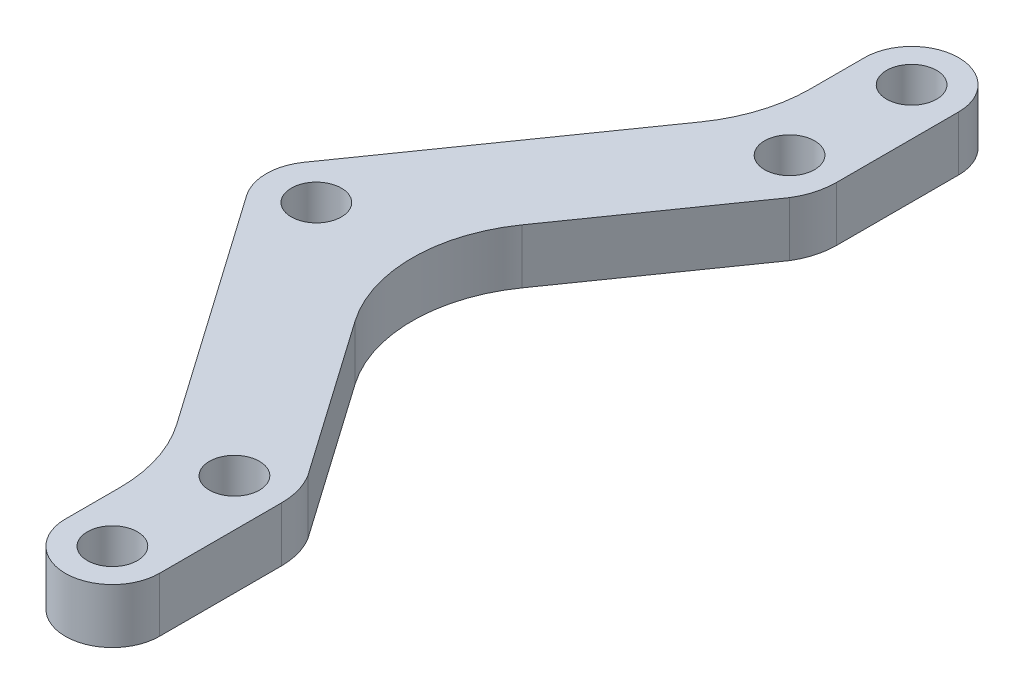
ISO-10303-21;
HEADER;
FILE_DESCRIPTION(('STEP AP214'),'2;1');
FILE_NAME('part.step','',(''),(''),'','','');
FILE_SCHEMA(('AUTOMOTIVE_DESIGN { 1 0 10303 214 1 1 1 1 }'));
ENDSEC;
DATA;
#1=APPLICATION_CONTEXT('core data for automotive mechanical design processes');
#2=APPLICATION_PROTOCOL_DEFINITION('international standard','automotive_design',2000,#1);
#3=PRODUCT_CONTEXT('',#1,'mechanical');
#4=PRODUCT('Part','Part','',(#3));
#5=PRODUCT_RELATED_PRODUCT_CATEGORY('part','',(#4));
#6=PRODUCT_DEFINITION_FORMATION('','',#4);
#7=PRODUCT_DEFINITION_CONTEXT('part definition',#1,'design');
#8=PRODUCT_DEFINITION('design','',#6,#7);
#9=PRODUCT_DEFINITION_SHAPE('','',#8);
#10=(LENGTH_UNIT() NAMED_UNIT(*) SI_UNIT(.MILLI.,.METRE.));
#11=(NAMED_UNIT(*) PLANE_ANGLE_UNIT() SI_UNIT($,.RADIAN.));
#12=(NAMED_UNIT(*) SI_UNIT($,.STERADIAN.) SOLID_ANGLE_UNIT());
#13=UNCERTAINTY_MEASURE_WITH_UNIT(LENGTH_MEASURE(1.E-05),#10,'distance_accuracy_value','');
#14=(GEOMETRIC_REPRESENTATION_CONTEXT(3) GLOBAL_UNCERTAINTY_ASSIGNED_CONTEXT((#13)) GLOBAL_UNIT_ASSIGNED_CONTEXT((#10,
#11,#12)) REPRESENTATION_CONTEXT('',''));
#15=CARTESIAN_POINT('',(0.,0.,0.));
#16=DIRECTION('',(0.,0.,1.));
#17=DIRECTION('',(1.,0.,0.));
#18=AXIS2_PLACEMENT_3D('',#15,#16,#17);
#19=CARTESIAN_POINT('',(-26.,3.,0.));
#20=DIRECTION('',(0.,-1.,0.));
#21=DIRECTION('',(0.,0.,-1.));
#22=AXIS2_PLACEMENT_3D('',#19,#20,#21);
#23=CYLINDRICAL_SURFACE('',#22,1.375);
#24=CARTESIAN_POINT('',(-26.,0.,0.));
#25=DIRECTION('',(0.,-1.,0.));
#26=DIRECTION('',(0.,0.,1.));
#27=AXIS2_PLACEMENT_3D('',#24,#25,#26);
#28=CIRCLE('',#27,1.375);
#29=CARTESIAN_POINT('',(-26.,0.,1.375));
#30=VERTEX_POINT('',#29);
#31=EDGE_CURVE('E195',#30,#30,#28,.T.);
#32=ORIENTED_EDGE('',*,*,#31,.T.);
#33=EDGE_LOOP('',(#32));
#34=FACE_BOUND('',#33,.T.);
#35=CARTESIAN_POINT('',(-26.,3.,0.));
#36=DIRECTION('',(0.,-1.,0.));
#37=DIRECTION('',(0.,0.,1.));
#38=AXIS2_PLACEMENT_3D('',#35,#36,#37);
#39=CIRCLE('',#38,1.375);
#40=CARTESIAN_POINT('',(-26.,3.,1.375));
#41=VERTEX_POINT('',#40);
#42=EDGE_CURVE('E201',#41,#41,#39,.T.);
#43=ORIENTED_EDGE('',*,*,#42,.F.);
#44=EDGE_LOOP('',(#43));
#45=FACE_BOUND('',#44,.T.);
#46=ADVANCED_FACE('F44',(#34,#45),#23,.F.);
#47=CARTESIAN_POINT('',(-13.2334631882938,3.,-13.2334631882938));
#48=DIRECTION('',(-0.819141395921878,0.,-0.57359164349488));
#49=DIRECTION('',(-0.57359164349488,0.,0.819141395921878));
#50=AXIS2_PLACEMENT_3D('',#47,#48,#49);
#51=PLANE('',#50);
#52=DIRECTION('',(0.57359164349488,0.,-0.819141395921878));
#53=VECTOR('',#52,1.);
#54=CARTESIAN_POINT('',(-13.2334631882938,3.,-13.2334631882938));
#55=LINE('',#54,#53);
#56=CARTESIAN_POINT('',(-19.286807502342,3.,-4.58873314795904));
#57=VERTEX_POINT('',#56);
#58=CARTESIAN_POINT('',(-13.2334631882938,3.,-13.2334631882938));
#59=VERTEX_POINT('',#58);
#60=EDGE_CURVE('E204',#57,#59,#55,.T.);
#61=ORIENTED_EDGE('',*,*,#60,.F.);
#62=DIRECTION('',(0.,-1.,0.));
#63=VECTOR('',#62,1.);
#64=CARTESIAN_POINT('',(-19.286807502342,3.,-4.58873314795904));
#65=LINE('',#64,#63);
#66=CARTESIAN_POINT('',(-19.286807502342,0.,-4.58873314795904));
#67=VERTEX_POINT('',#66);
#68=EDGE_CURVE('E254',#57,#67,#65,.T.);
#69=ORIENTED_EDGE('',*,*,#68,.T.);
#70=DIRECTION('',(0.57359164349488,0.,-0.819141395921878));
#71=VECTOR('',#70,1.);
#72=CARTESIAN_POINT('',(-13.2334631882938,0.,-13.2334631882938));
#73=LINE('',#72,#71);
#74=CARTESIAN_POINT('',(-13.2334631882938,0.,-13.2334631882938));
#75=VERTEX_POINT('',#74);
#76=EDGE_CURVE('E218',#67,#75,#73,.T.);
#77=ORIENTED_EDGE('',*,*,#76,.T.);
#78=DIRECTION('',(0.,-1.,0.));
#79=VECTOR('',#78,1.);
#80=CARTESIAN_POINT('',(-13.2334631882938,3.,-13.2334631882938));
#81=LINE('',#80,#79);
#82=EDGE_CURVE('E242',#59,#75,#81,.T.);
#83=ORIENTED_EDGE('',*,*,#82,.F.);
#84=EDGE_LOOP('',(#61,#69,#77,#83));
#85=FACE_BOUND('',#84,.T.);
#86=ADVANCED_FACE('F297',(#85),#51,.F.);
#87=CARTESIAN_POINT('',(-16.5287908450578,3.,-15.25));
#88=DIRECTION('',(0.,-1.,0.));
#89=DIRECTION('',(0.,0.,-1.));
#90=AXIS2_PLACEMENT_3D('',#87,#88,#89);
#91=CYLINDRICAL_SURFACE('',#90,3.86336706493177);
#92=CARTESIAN_POINT('',(-16.5287908450578,0.,-15.25));
#93=DIRECTION('',(0.,1.,0.));
#94=DIRECTION('',(0.,0.,-1.));
#95=AXIS2_PLACEMENT_3D('',#92,#93,#94);
#96=CIRCLE('',#95,3.86336706493177);
#97=CARTESIAN_POINT('',(-12.665423780126,0.,-15.25));
#98=VERTEX_POINT('',#97);
#99=EDGE_CURVE('E220',#75,#98,#96,.T.);
#100=ORIENTED_EDGE('',*,*,#99,.T.);
#101=DIRECTION('',(0.,-1.,0.));
#102=VECTOR('',#101,1.);
#103=CARTESIAN_POINT('',(-12.665423780126,3.,-15.25));
#104=LINE('',#103,#102);
#105=CARTESIAN_POINT('',(-12.665423780126,3.,-15.25));
#106=VERTEX_POINT('',#105);
#107=EDGE_CURVE('E239',#106,#98,#104,.T.);
#108=ORIENTED_EDGE('',*,*,#107,.F.);
#109=CARTESIAN_POINT('',(-16.5287908450578,3.,-15.25));
#110=DIRECTION('',(0.,1.,0.));
#111=DIRECTION('',(0.,0.,-1.));
#112=AXIS2_PLACEMENT_3D('',#109,#110,#111);
#113=CIRCLE('',#112,3.86336706493177);
#114=EDGE_CURVE('E206',#59,#106,#113,.T.);
#115=ORIENTED_EDGE('',*,*,#114,.F.);
#116=ORIENTED_EDGE('',*,*,#82,.T.);
#117=EDGE_LOOP('',(#100,#108,#115,#116));
#118=FACE_BOUND('',#117,.T.);
#119=ADVANCED_FACE('F293',(#118),#91,.T.);
#120=CARTESIAN_POINT('',(-12.665423780126,3.,-21.9553245163001));
#121=DIRECTION('',(-1.,0.,0.));
#122=DIRECTION('',(0.,0.,1.));
#123=AXIS2_PLACEMENT_3D('',#120,#121,#122);
#124=PLANE('',#123);
#125=DIRECTION('',(0.,0.,-1.));
#126=VECTOR('',#125,1.);
#127=CARTESIAN_POINT('',(-12.665423780126,0.,-21.9553245163001));
#128=LINE('',#127,#126);
#129=CARTESIAN_POINT('',(-12.665423780126,0.,-21.9553245163001));
#130=VERTEX_POINT('',#129);
#131=EDGE_CURVE('E222',#98,#130,#128,.T.);
#132=ORIENTED_EDGE('',*,*,#131,.T.);
#133=DIRECTION('',(0.,-1.,0.));
#134=VECTOR('',#133,1.);
#135=CARTESIAN_POINT('',(-12.665423780126,3.,-21.9553245163001));
#136=LINE('',#135,#134);
#137=CARTESIAN_POINT('',(-12.665423780126,3.,-21.9553245163001));
#138=VERTEX_POINT('',#137);
#139=EDGE_CURVE('E236',#138,#130,#136,.T.);
#140=ORIENTED_EDGE('',*,*,#139,.F.);
#141=DIRECTION('',(0.,0.,-1.));
#142=VECTOR('',#141,1.);
#143=CARTESIAN_POINT('',(-12.665423780126,3.,-21.9553245163001));
#144=LINE('',#143,#142);
#145=EDGE_CURVE('E208',#106,#138,#144,.T.);
#146=ORIENTED_EDGE('',*,*,#145,.F.);
#147=ORIENTED_EDGE('',*,*,#107,.T.);
#148=EDGE_LOOP('',(#132,#140,#146,#147));
#149=FACE_BOUND('',#148,.T.);
#150=ADVANCED_FACE('F288',(#149),#124,.F.);
#151=CARTESIAN_POINT('',(-15.25,3.,-21.9553245163001));
#152=DIRECTION('',(0.,-1.,0.));
#153=DIRECTION('',(0.,0.,-1.));
#154=AXIS2_PLACEMENT_3D('',#151,#152,#153);
#155=CYLINDRICAL_SURFACE('',#154,2.58457621987399);
#156=CARTESIAN_POINT('',(-15.25,0.,-21.9553245163001));
#157=DIRECTION('',(0.,1.,0.));
#158=DIRECTION('',(0.,0.,1.));
#159=AXIS2_PLACEMENT_3D('',#156,#157,#158);
#160=CIRCLE('',#159,2.58457621987399);
#161=CARTESIAN_POINT('',(-17.834576219874,0.,-21.9553245163001));
#162=VERTEX_POINT('',#161);
#163=EDGE_CURVE('E224',#130,#162,#160,.T.);
#164=ORIENTED_EDGE('',*,*,#163,.T.);
#165=DIRECTION('',(0.,-1.,0.));
#166=VECTOR('',#165,1.);
#167=CARTESIAN_POINT('',(-17.834576219874,3.,-21.9553245163001));
#168=LINE('',#167,#166);
#169=CARTESIAN_POINT('',(-17.834576219874,3.,-21.9553245163001));
#170=VERTEX_POINT('',#169);
#171=EDGE_CURVE('E233',#170,#162,#168,.T.);
#172=ORIENTED_EDGE('',*,*,#171,.F.);
#173=CARTESIAN_POINT('',(-15.25,3.,-21.9553245163001));
#174=DIRECTION('',(0.,1.,0.));
#175=DIRECTION('',(0.,0.,1.));
#176=AXIS2_PLACEMENT_3D('',#173,#174,#175);
#177=CIRCLE('',#176,2.58457621987399);
#178=EDGE_CURVE('E210',#138,#170,#177,.T.);
#179=ORIENTED_EDGE('',*,*,#178,.F.);
#180=ORIENTED_EDGE('',*,*,#139,.T.);
#181=EDGE_LOOP('',(#164,#172,#179,#180));
#182=FACE_BOUND('',#181,.T.);
#183=ADVANCED_FACE('F283',(#182),#155,.T.);
#184=CARTESIAN_POINT('',(-17.834576219874,3.,-16.4553245163001));
#185=DIRECTION('',(1.,0.,0.));
#186=DIRECTION('',(0.,0.,-1.));
#187=AXIS2_PLACEMENT_3D('',#184,#185,#186);
#188=PLANE('',#187);
#189=DIRECTION('',(0.,0.,1.));
#190=VECTOR('',#189,1.);
#191=CARTESIAN_POINT('',(-17.834576219874,0.,-16.4553245163001));
#192=LINE('',#191,#190);
#193=CARTESIAN_POINT('',(-17.834576219874,0.,-18.9777964683133));
#194=VERTEX_POINT('',#193);
#195=EDGE_CURVE('E226',#162,#194,#192,.T.);
#196=ORIENTED_EDGE('',*,*,#195,.T.);
#197=DIRECTION('',(0.,-1.,0.));
#198=VECTOR('',#197,1.);
#199=CARTESIAN_POINT('',(-17.834576219874,3.,-18.9777964683133));
#200=LINE('',#199,#198);
#201=CARTESIAN_POINT('',(-17.834576219874,3.,-18.9777964683133));
#202=VERTEX_POINT('',#201);
#203=EDGE_CURVE('E252',#194,#202,#200,.F.);
#204=ORIENTED_EDGE('',*,*,#203,.T.);
#205=DIRECTION('',(0.,0.,1.));
#206=VECTOR('',#205,1.);
#207=CARTESIAN_POINT('',(-17.834576219874,3.,-16.4553245163001));
#208=LINE('',#207,#206);
#209=EDGE_CURVE('E212',#170,#202,#208,.T.);
#210=ORIENTED_EDGE('',*,*,#209,.F.);
#211=ORIENTED_EDGE('',*,*,#171,.T.);
#212=EDGE_LOOP('',(#196,#204,#210,#211));
#213=FACE_BOUND('',#212,.T.);
#214=ADVANCED_FACE('F279',(#213),#188,.F.);
#215=CARTESIAN_POINT('',(-17.834576219874,3.,-16.4553245163001));
#216=DIRECTION('',(0.819141395921878,0.,0.573591643494881));
#217=DIRECTION('',(0.573591643494881,0.,-0.819141395921878));
#218=AXIS2_PLACEMENT_3D('',#215,#216,#217);
#219=PLANE('',#218);
#220=DIRECTION('',(-0.57359164349488,0.,0.819141395921877));
#221=VECTOR('',#220,1.);
#222=CARTESIAN_POINT('',(-17.834576219874,3.,-16.4553245163001));
#223=LINE('',#222,#221);
#224=CARTESIAN_POINT('',(-19.281445052499,3.,-14.3890633203542));
#225=VERTEX_POINT('',#224);
#226=CARTESIAN_POINT('',(-28.2526388387852,3.,-1.57737701961096));
#227=VERTEX_POINT('',#226);
#228=EDGE_CURVE('E172',#225,#227,#223,.T.);
#229=ORIENTED_EDGE('',*,*,#228,.F.);
#230=DIRECTION('',(0.,-1.,0.));
#231=VECTOR('',#230,1.);
#232=CARTESIAN_POINT('',(-19.281445052499,0.,-14.3890633203542));
#233=LINE('',#232,#231);
#234=CARTESIAN_POINT('',(-19.281445052499,0.,-14.3890633203542));
#235=VERTEX_POINT('',#234);
#236=EDGE_CURVE('E249',#225,#235,#233,.T.);
#237=ORIENTED_EDGE('',*,*,#236,.T.);
#238=DIRECTION('',(-0.57359164349488,0.,0.819141395921877));
#239=VECTOR('',#238,1.);
#240=CARTESIAN_POINT('',(-17.834576219874,0.,-16.4553245163001));
#241=LINE('',#240,#239);
#242=CARTESIAN_POINT('',(-28.2526388387852,0.,-1.57737701961096));
#243=VERTEX_POINT('',#242);
#244=EDGE_CURVE('E229',#235,#243,#241,.T.);
#245=ORIENTED_EDGE('',*,*,#244,.T.);
#246=DIRECTION('',(0.,-1.,0.));
#247=VECTOR('',#246,1.);
#248=CARTESIAN_POINT('',(-28.2526388387852,3.,-1.57737701961096));
#249=LINE('',#248,#247);
#250=EDGE_CURVE('E176',#227,#243,#249,.T.);
#251=ORIENTED_EDGE('',*,*,#250,.F.);
#252=EDGE_LOOP('',(#229,#237,#245,#251));
#253=FACE_BOUND('',#252,.T.);
#254=ADVANCED_FACE('F271',(#253),#219,.F.);
#255=CARTESIAN_POINT('',(-26.,3.,0.));
#256=DIRECTION('',(0.,-1.,0.));
#257=DIRECTION('',(0.,0.,-1.));
#258=AXIS2_PLACEMENT_3D('',#255,#256,#257);
#259=CYLINDRICAL_SURFACE('',#258,2.75000000000006);
#260=CARTESIAN_POINT('',(-26.,0.,0.));
#261=DIRECTION('',(0.,1.,0.));
#262=DIRECTION('',(0.,0.,1.));
#263=AXIS2_PLACEMENT_3D('',#260,#261,#262);
#264=CIRCLE('',#263,2.75000000000006);
#265=CARTESIAN_POINT('',(-28.2526388387852,0.,1.57737701961096));
#266=VERTEX_POINT('',#265);
#267=EDGE_CURVE('E181',#243,#266,#264,.T.);
#268=ORIENTED_EDGE('',*,*,#267,.T.);
#269=DIRECTION('',(0.,-1.,0.));
#270=VECTOR('',#269,1.);
#271=CARTESIAN_POINT('',(-28.2526388387852,3.,1.57737701961096));
#272=LINE('',#271,#270);
#273=CARTESIAN_POINT('',(-28.2526388387852,3.,1.57737701961096));
#274=VERTEX_POINT('',#273);
#275=EDGE_CURVE('E160',#274,#266,#272,.T.);
#276=ORIENTED_EDGE('',*,*,#275,.F.);
#277=CARTESIAN_POINT('',(-26.,3.,0.));
#278=DIRECTION('',(0.,1.,0.));
#279=DIRECTION('',(0.,0.,1.));
#280=AXIS2_PLACEMENT_3D('',#277,#278,#279);
#281=CIRCLE('',#280,2.75000000000006);
#282=EDGE_CURVE('E169',#227,#274,#281,.T.);
#283=ORIENTED_EDGE('',*,*,#282,.F.);
#284=ORIENTED_EDGE('',*,*,#250,.T.);
#285=EDGE_LOOP('',(#268,#276,#283,#284));
#286=FACE_BOUND('',#285,.T.);
#287=ADVANCED_FACE('F179',(#286),#259,.T.);
#288=CARTESIAN_POINT('',(-26.,3.,0.));
#289=DIRECTION('',(0.,1.,0.));
#290=DIRECTION('',(0.,0.,1.));
#291=AXIS2_PLACEMENT_3D('',#288,#289,#290);
#292=PLANE('',#291);
#293=CARTESIAN_POINT('',(-15.25,3.,15.25));
#294=DIRECTION('',(0.,-1.,0.));
#295=DIRECTION('',(0.,0.,-1.));
#296=AXIS2_PLACEMENT_3D('',#293,#294,#295);
#297=CIRCLE('',#296,1.37499999999999);
#298=CARTESIAN_POINT('',(-15.25,3.,13.875));
#299=VERTEX_POINT('',#298);
#300=EDGE_CURVE('E356',#299,#299,#297,.T.);
#301=ORIENTED_EDGE('',*,*,#300,.T.);
#302=EDGE_LOOP('',(#301));
#303=FACE_BOUND('',#302,.T.);
#304=CARTESIAN_POINT('',(-15.25,3.,21.9553245163001));
#305=DIRECTION('',(0.,-1.,0.));
#306=DIRECTION('',(0.,0.,-1.));
#307=AXIS2_PLACEMENT_3D('',#304,#305,#306);
#308=CIRCLE('',#307,1.37499999999999);
#309=CARTESIAN_POINT('',(-15.25,3.,20.5803245163001));
#310=VERTEX_POINT('',#309);
#311=EDGE_CURVE('E350',#310,#310,#308,.T.);
#312=ORIENTED_EDGE('',*,*,#311,.T.);
#313=EDGE_LOOP('',(#312));
#314=FACE_BOUND('',#313,.T.);
#315=ORIENTED_EDGE('',*,*,#42,.T.);
#316=EDGE_LOOP('',(#315));
#317=FACE_BOUND('',#316,.T.);
#318=CARTESIAN_POINT('',(-15.25,3.,-15.25));
#319=DIRECTION('',(0.,1.,0.));
#320=DIRECTION('',(0.,0.,1.));
#321=AXIS2_PLACEMENT_3D('',#318,#319,#320);
#322=CIRCLE('',#321,1.37499999999999);
#323=CARTESIAN_POINT('',(-15.25,3.,-13.875));
#324=VERTEX_POINT('',#323);
#325=EDGE_CURVE('E196',#324,#324,#322,.T.);
#326=ORIENTED_EDGE('',*,*,#325,.F.);
#327=EDGE_LOOP('',(#326));
#328=FACE_BOUND('',#327,.T.);
#329=CARTESIAN_POINT('',(-15.25,3.,-21.9553245163001));
#330=DIRECTION('',(0.,1.,0.));
#331=DIRECTION('',(0.,0.,1.));
#332=AXIS2_PLACEMENT_3D('',#329,#330,#331);
#333=CIRCLE('',#332,1.37499999999999);
#334=CARTESIAN_POINT('',(-15.25,3.,-20.5803245163001));
#335=VERTEX_POINT('',#334);
#336=EDGE_CURVE('E186',#335,#335,#333,.T.);
#337=ORIENTED_EDGE('',*,*,#336,.F.);
#338=EDGE_LOOP('',(#337));
#339=FACE_BOUND('',#338,.T.);
#340=ORIENTED_EDGE('',*,*,#282,.T.);
#341=DIRECTION('',(-0.57359164349488,0.,-0.819141395921877));
#342=VECTOR('',#341,1.);
#343=CARTESIAN_POINT('',(-17.834576219874,3.,16.4553245163001));
#344=LINE('',#343,#342);
#345=CARTESIAN_POINT('',(-19.281445052499,3.,14.3890633203542));
#346=VERTEX_POINT('',#345);
#347=EDGE_CURVE('E155',#346,#274,#344,.T.);
#348=ORIENTED_EDGE('',*,*,#347,.F.);
#349=CARTESIAN_POINT('',(-25.834576219874,3.,18.9777964683133));
#350=DIRECTION('',(0.,1.,0.));
#351=DIRECTION('',(0.,0.,1.));
#352=AXIS2_PLACEMENT_3D('',#349,#350,#351);
#353=CIRCLE('',#352,8.);
#354=CARTESIAN_POINT('',(-17.834576219874,3.,18.9777964683133));
#355=VERTEX_POINT('',#354);
#356=EDGE_CURVE('E260',#346,#355,#353,.F.);
#357=ORIENTED_EDGE('',*,*,#356,.T.);
#358=DIRECTION('',(0.,0.,-1.));
#359=VECTOR('',#358,1.);
#360=CARTESIAN_POINT('',(-17.834576219874,3.,16.4553245163001));
#361=LINE('',#360,#359);
#362=CARTESIAN_POINT('',(-17.834576219874,3.,21.9553245163001));
#363=VERTEX_POINT('',#362);
#364=EDGE_CURVE('E165',#363,#355,#361,.T.);
#365=ORIENTED_EDGE('',*,*,#364,.F.);
#366=CARTESIAN_POINT('',(-15.25,3.,21.9553245163001));
#367=DIRECTION('',(0.,-1.,0.));
#368=DIRECTION('',(0.,0.,-1.));
#369=AXIS2_PLACEMENT_3D('',#366,#367,#368);
#370=CIRCLE('',#369,2.58457621987399);
#371=CARTESIAN_POINT('',(-12.665423780126,3.,21.9553245163001));
#372=VERTEX_POINT('',#371);
#373=EDGE_CURVE('E345',#372,#363,#370,.T.);
#374=ORIENTED_EDGE('',*,*,#373,.F.);
#375=DIRECTION('',(0.,0.,1.));
#376=VECTOR('',#375,1.);
#377=CARTESIAN_POINT('',(-12.665423780126,3.,21.9553245163001));
#378=LINE('',#377,#376);
#379=CARTESIAN_POINT('',(-12.665423780126,3.,15.25));
#380=VERTEX_POINT('',#379);
#381=EDGE_CURVE('E312',#380,#372,#378,.T.);
#382=ORIENTED_EDGE('',*,*,#381,.F.);
#383=CARTESIAN_POINT('',(-16.5287908450578,3.,15.25));
#384=DIRECTION('',(0.,-1.,0.));
#385=DIRECTION('',(0.,0.,1.));
#386=AXIS2_PLACEMENT_3D('',#383,#384,#385);
#387=CIRCLE('',#386,3.86336706493177);
#388=CARTESIAN_POINT('',(-13.2334631882938,3.,13.2334631882938));
#389=VERTEX_POINT('',#388);
#390=EDGE_CURVE('E305',#389,#380,#387,.T.);
#391=ORIENTED_EDGE('',*,*,#390,.F.);
#392=DIRECTION('',(0.57359164349488,0.,0.819141395921878));
#393=VECTOR('',#392,1.);
#394=CARTESIAN_POINT('',(-13.2334631882938,3.,13.2334631882938));
#395=LINE('',#394,#393);
#396=CARTESIAN_POINT('',(-19.286807502342,3.,4.58873314795904));
#397=VERTEX_POINT('',#396);
#398=EDGE_CURVE('E302',#397,#389,#395,.T.);
#399=ORIENTED_EDGE('',*,*,#398,.F.);
#400=CARTESIAN_POINT('',(-12.733676334967,3.,0.));
#401=DIRECTION('',(0.,1.,0.));
#402=DIRECTION('',(0.,0.,1.));
#403=AXIS2_PLACEMENT_3D('',#400,#401,#402);
#404=CIRCLE('',#403,8.);
#405=EDGE_CURVE('E11',#397,#57,#404,.F.);
#406=ORIENTED_EDGE('',*,*,#405,.T.);
#407=ORIENTED_EDGE('',*,*,#60,.T.);
#408=ORIENTED_EDGE('',*,*,#114,.T.);
#409=ORIENTED_EDGE('',*,*,#145,.T.);
#410=ORIENTED_EDGE('',*,*,#178,.T.);
#411=ORIENTED_EDGE('',*,*,#209,.T.);
#412=CARTESIAN_POINT('',(-25.834576219874,3.,-18.9777964683133));
#413=DIRECTION('',(0.,1.,0.));
#414=DIRECTION('',(0.,0.,1.));
#415=AXIS2_PLACEMENT_3D('',#412,#413,#414);
#416=CIRCLE('',#415,8.);
#417=EDGE_CURVE('E264',#202,#225,#416,.F.);
#418=ORIENTED_EDGE('',*,*,#417,.T.);
#419=ORIENTED_EDGE('',*,*,#228,.T.);
#420=EDGE_LOOP('',(#340,#348,#357,#365,#374,#382,#391,#399,#406,#407,#408,#409,#410,#411,#418,#419));
#421=FACE_BOUND('',#420,.T.);
#422=ADVANCED_FACE('F170',(#303,#314,#317,#328,#339,#421),#292,.T.);
#423=CARTESIAN_POINT('',(-26.,0.,0.));
#424=DIRECTION('',(0.,1.,0.));
#425=DIRECTION('',(0.,0.,1.));
#426=AXIS2_PLACEMENT_3D('',#423,#424,#425);
#427=PLANE('',#426);
#428=CARTESIAN_POINT('',(-15.25,0.,15.25));
#429=DIRECTION('',(0.,-1.,0.));
#430=DIRECTION('',(0.,0.,-1.));
#431=AXIS2_PLACEMENT_3D('',#428,#429,#430);
#432=CIRCLE('',#431,1.37499999999999);
#433=CARTESIAN_POINT('',(-15.25,0.,13.875));
#434=VERTEX_POINT('',#433);
#435=EDGE_CURVE('E319',#434,#434,#432,.T.);
#436=ORIENTED_EDGE('',*,*,#435,.F.);
#437=EDGE_LOOP('',(#436));
#438=FACE_BOUND('',#437,.T.);
#439=CARTESIAN_POINT('',(-15.25,0.,21.9553245163001));
#440=DIRECTION('',(0.,-1.,0.));
#441=DIRECTION('',(0.,0.,-1.));
#442=AXIS2_PLACEMENT_3D('',#439,#440,#441);
#443=CIRCLE('',#442,1.37499999999999);
#444=CARTESIAN_POINT('',(-15.25,0.,20.5803245163001));
#445=VERTEX_POINT('',#444);
#446=EDGE_CURVE('E353',#445,#445,#443,.T.);
#447=ORIENTED_EDGE('',*,*,#446,.F.);
#448=EDGE_LOOP('',(#447));
#449=FACE_BOUND('',#448,.T.);
#450=ORIENTED_EDGE('',*,*,#31,.F.);
#451=EDGE_LOOP('',(#450));
#452=FACE_BOUND('',#451,.T.);
#453=CARTESIAN_POINT('',(-15.25,0.,-15.25));
#454=DIRECTION('',(0.,1.,0.));
#455=DIRECTION('',(0.,0.,1.));
#456=AXIS2_PLACEMENT_3D('',#453,#454,#455);
#457=CIRCLE('',#456,1.37499999999999);
#458=CARTESIAN_POINT('',(-15.25,0.,-13.875));
#459=VERTEX_POINT('',#458);
#460=EDGE_CURVE('E192',#459,#459,#457,.T.);
#461=ORIENTED_EDGE('',*,*,#460,.T.);
#462=EDGE_LOOP('',(#461));
#463=FACE_BOUND('',#462,.T.);
#464=CARTESIAN_POINT('',(-15.25,0.,-21.9553245163001));
#465=DIRECTION('',(0.,1.,0.));
#466=DIRECTION('',(0.,0.,1.));
#467=AXIS2_PLACEMENT_3D('',#464,#465,#466);
#468=CIRCLE('',#467,1.37499999999999);
#469=CARTESIAN_POINT('',(-15.25,0.,-20.5803245163001));
#470=VERTEX_POINT('',#469);
#471=EDGE_CURVE('E182',#470,#470,#468,.T.);
#472=ORIENTED_EDGE('',*,*,#471,.T.);
#473=EDGE_LOOP('',(#472));
#474=FACE_BOUND('',#473,.T.);
#475=DIRECTION('',(0.,0.,-1.));
#476=VECTOR('',#475,1.);
#477=CARTESIAN_POINT('',(-17.834576219874,0.,16.4553245163001));
#478=LINE('',#477,#476);
#479=CARTESIAN_POINT('',(-17.834576219874,0.,21.9553245163001));
#480=VERTEX_POINT('',#479);
#481=CARTESIAN_POINT('',(-17.834576219874,0.,18.9777964683133));
#482=VERTEX_POINT('',#481);
#483=EDGE_CURVE('E318',#480,#482,#478,.T.);
#484=ORIENTED_EDGE('',*,*,#483,.T.);
#485=CARTESIAN_POINT('',(-25.834576219874,0.,18.9777964683133));
#486=DIRECTION('',(0.,1.,0.));
#487=DIRECTION('',(0.,0.,1.));
#488=AXIS2_PLACEMENT_3D('',#485,#486,#487);
#489=CIRCLE('',#488,8.);
#490=CARTESIAN_POINT('',(-19.281445052499,0.,14.3890633203542));
#491=VERTEX_POINT('',#490);
#492=EDGE_CURVE('E258',#482,#491,#489,.T.);
#493=ORIENTED_EDGE('',*,*,#492,.T.);
#494=DIRECTION('',(-0.57359164349488,0.,-0.819141395921877));
#495=VECTOR('',#494,1.);
#496=CARTESIAN_POINT('',(-17.834576219874,0.,16.4553245163001));
#497=LINE('',#496,#495);
#498=EDGE_CURVE('E316',#491,#266,#497,.T.);
#499=ORIENTED_EDGE('',*,*,#498,.T.);
#500=ORIENTED_EDGE('',*,*,#267,.F.);
#501=ORIENTED_EDGE('',*,*,#244,.F.);
#502=CARTESIAN_POINT('',(-25.834576219874,0.,-18.9777964683133));
#503=DIRECTION('',(0.,1.,0.));
#504=DIRECTION('',(0.,0.,1.));
#505=AXIS2_PLACEMENT_3D('',#502,#503,#504);
#506=CIRCLE('',#505,8.);
#507=EDGE_CURVE('E262',#235,#194,#506,.T.);
#508=ORIENTED_EDGE('',*,*,#507,.T.);
#509=ORIENTED_EDGE('',*,*,#195,.F.);
#510=ORIENTED_EDGE('',*,*,#163,.F.);
#511=ORIENTED_EDGE('',*,*,#131,.F.);
#512=ORIENTED_EDGE('',*,*,#99,.F.);
#513=ORIENTED_EDGE('',*,*,#76,.F.);
#514=CARTESIAN_POINT('',(-12.733676334967,0.,0.));
#515=DIRECTION('',(0.,1.,0.));
#516=DIRECTION('',(0.,0.,1.));
#517=AXIS2_PLACEMENT_3D('',#514,#515,#516);
#518=CIRCLE('',#517,8.);
#519=CARTESIAN_POINT('',(-19.286807502342,0.,4.58873314795904));
#520=VERTEX_POINT('',#519);
#521=EDGE_CURVE('E52',#67,#520,#518,.T.);
#522=ORIENTED_EDGE('',*,*,#521,.T.);
#523=DIRECTION('',(0.57359164349488,0.,0.819141395921878));
#524=VECTOR('',#523,1.);
#525=CARTESIAN_POINT('',(-13.2334631882938,0.,13.2334631882938));
#526=LINE('',#525,#524);
#527=CARTESIAN_POINT('',(-13.2334631882938,0.,13.2334631882938));
#528=VERTEX_POINT('',#527);
#529=EDGE_CURVE('E166',#520,#528,#526,.T.);
#530=ORIENTED_EDGE('',*,*,#529,.T.);
#531=CARTESIAN_POINT('',(-16.5287908450578,0.,15.25));
#532=DIRECTION('',(0.,-1.,0.));
#533=DIRECTION('',(0.,0.,1.));
#534=AXIS2_PLACEMENT_3D('',#531,#532,#533);
#535=CIRCLE('',#534,3.86336706493177);
#536=CARTESIAN_POINT('',(-12.665423780126,0.,15.25));
#537=VERTEX_POINT('',#536);
#538=EDGE_CURVE('E327',#528,#537,#535,.T.);
#539=ORIENTED_EDGE('',*,*,#538,.T.);
#540=DIRECTION('',(0.,0.,1.));
#541=VECTOR('',#540,1.);
#542=CARTESIAN_POINT('',(-12.665423780126,0.,21.9553245163001));
#543=LINE('',#542,#541);
#544=CARTESIAN_POINT('',(-12.665423780126,0.,21.9553245163001));
#545=VERTEX_POINT('',#544);
#546=EDGE_CURVE('E324',#537,#545,#543,.T.);
#547=ORIENTED_EDGE('',*,*,#546,.T.);
#548=CARTESIAN_POINT('',(-15.25,0.,21.9553245163001));
#549=DIRECTION('',(0.,-1.,0.));
#550=DIRECTION('',(0.,0.,-1.));
#551=AXIS2_PLACEMENT_3D('',#548,#549,#550);
#552=CIRCLE('',#551,2.58457621987399);
#553=EDGE_CURVE('E321',#545,#480,#552,.T.);
#554=ORIENTED_EDGE('',*,*,#553,.T.);
#555=EDGE_LOOP('',(#484,#493,#499,#500,#501,#508,#509,#510,#511,#512,#513,#522,#530,#539,#547,#554));
#556=FACE_BOUND('',#555,.T.);
#557=ADVANCED_FACE('F276',(#438,#449,#452,#463,#474,#556),#427,.F.);
#558=CARTESIAN_POINT('',(-15.25,0.,-21.9553245163001));
#559=DIRECTION('',(0.,1.,0.));
#560=DIRECTION('',(0.,0.,1.));
#561=AXIS2_PLACEMENT_3D('',#558,#559,#560);
#562=CYLINDRICAL_SURFACE('',#561,1.37499999999999);
#563=ORIENTED_EDGE('',*,*,#471,.F.);
#564=EDGE_LOOP('',(#563));
#565=FACE_BOUND('',#564,.T.);
#566=ORIENTED_EDGE('',*,*,#336,.T.);
#567=EDGE_LOOP('',(#566));
#568=FACE_BOUND('',#567,.T.);
#569=ADVANCED_FACE('F367',(#565,#568),#562,.F.);
#570=CARTESIAN_POINT('',(-15.25,0.,-15.25));
#571=DIRECTION('',(0.,1.,0.));
#572=DIRECTION('',(0.,0.,1.));
#573=AXIS2_PLACEMENT_3D('',#570,#571,#572);
#574=CYLINDRICAL_SURFACE('',#573,1.37499999999999);
#575=ORIENTED_EDGE('',*,*,#460,.F.);
#576=EDGE_LOOP('',(#575));
#577=FACE_BOUND('',#576,.T.);
#578=ORIENTED_EDGE('',*,*,#325,.T.);
#579=EDGE_LOOP('',(#578));
#580=FACE_BOUND('',#579,.T.);
#581=ADVANCED_FACE('F379',(#577,#580),#574,.F.);
#582=CARTESIAN_POINT('',(-17.834576219874,3.,16.4553245163001));
#583=DIRECTION('',(-0.819141395921878,0.,0.573591643494881));
#584=DIRECTION('',(0.573591643494881,0.,0.819141395921878));
#585=AXIS2_PLACEMENT_3D('',#582,#583,#584);
#586=PLANE('',#585);
#587=ORIENTED_EDGE('',*,*,#498,.F.);
#588=DIRECTION('',(0.,-1.,0.));
#589=VECTOR('',#588,1.);
#590=CARTESIAN_POINT('',(-19.281445052499,3.,14.3890633203542));
#591=LINE('',#590,#589);
#592=EDGE_CURVE('E162',#491,#346,#591,.F.);
#593=ORIENTED_EDGE('',*,*,#592,.T.);
#594=ORIENTED_EDGE('',*,*,#347,.T.);
#595=ORIENTED_EDGE('',*,*,#275,.T.);
#596=EDGE_LOOP('',(#587,#593,#594,#595));
#597=FACE_BOUND('',#596,.T.);
#598=ADVANCED_FACE('F158',(#597),#586,.T.);
#599=CARTESIAN_POINT('',(-17.834576219874,3.,16.4553245163001));
#600=DIRECTION('',(-1.,0.,0.));
#601=DIRECTION('',(0.,0.,1.));
#602=AXIS2_PLACEMENT_3D('',#599,#600,#601);
#603=PLANE('',#602);
#604=ORIENTED_EDGE('',*,*,#364,.T.);
#605=DIRECTION('',(0.,-1.,0.));
#606=VECTOR('',#605,1.);
#607=CARTESIAN_POINT('',(-17.834576219874,0.,18.9777964683133));
#608=LINE('',#607,#606);
#609=EDGE_CURVE('E245',#355,#482,#608,.T.);
#610=ORIENTED_EDGE('',*,*,#609,.T.);
#611=ORIENTED_EDGE('',*,*,#483,.F.);
#612=DIRECTION('',(0.,-1.,0.));
#613=VECTOR('',#612,1.);
#614=CARTESIAN_POINT('',(-17.834576219874,3.,21.9553245163001));
#615=LINE('',#614,#613);
#616=EDGE_CURVE('E183',#363,#480,#615,.T.);
#617=ORIENTED_EDGE('',*,*,#616,.F.);
#618=EDGE_LOOP('',(#604,#610,#611,#617));
#619=FACE_BOUND('',#618,.T.);
#620=ADVANCED_FACE('F476',(#619),#603,.T.);
#621=CARTESIAN_POINT('',(-15.25,3.,21.9553245163001));
#622=DIRECTION('',(0.,-1.,0.));
#623=DIRECTION('',(0.,0.,-1.));
#624=AXIS2_PLACEMENT_3D('',#621,#622,#623);
#625=CYLINDRICAL_SURFACE('',#624,2.58457621987399);
#626=ORIENTED_EDGE('',*,*,#553,.F.);
#627=DIRECTION('',(0.,-1.,0.));
#628=VECTOR('',#627,1.);
#629=CARTESIAN_POINT('',(-12.665423780126,3.,21.9553245163001));
#630=LINE('',#629,#628);
#631=EDGE_CURVE('E188',#372,#545,#630,.T.);
#632=ORIENTED_EDGE('',*,*,#631,.F.);
#633=ORIENTED_EDGE('',*,*,#373,.T.);
#634=ORIENTED_EDGE('',*,*,#616,.T.);
#635=EDGE_LOOP('',(#626,#632,#633,#634));
#636=FACE_BOUND('',#635,.T.);
#637=ADVANCED_FACE('F339',(#636),#625,.T.);
#638=CARTESIAN_POINT('',(-12.665423780126,3.,21.9553245163001));
#639=DIRECTION('',(1.,0.,0.));
#640=DIRECTION('',(0.,0.,-1.));
#641=AXIS2_PLACEMENT_3D('',#638,#639,#640);
#642=PLANE('',#641);
#643=ORIENTED_EDGE('',*,*,#546,.F.);
#644=DIRECTION('',(0.,-1.,0.));
#645=VECTOR('',#644,1.);
#646=CARTESIAN_POINT('',(-12.665423780126,3.,15.25));
#647=LINE('',#646,#645);
#648=EDGE_CURVE('E310',#380,#537,#647,.T.);
#649=ORIENTED_EDGE('',*,*,#648,.F.);
#650=ORIENTED_EDGE('',*,*,#381,.T.);
#651=ORIENTED_EDGE('',*,*,#631,.T.);
#652=EDGE_LOOP('',(#643,#649,#650,#651));
#653=FACE_BOUND('',#652,.T.);
#654=ADVANCED_FACE('F335',(#653),#642,.T.);
#655=CARTESIAN_POINT('',(-16.5287908450578,3.,15.25));
#656=DIRECTION('',(0.,-1.,0.));
#657=DIRECTION('',(0.,0.,-1.));
#658=AXIS2_PLACEMENT_3D('',#655,#656,#657);
#659=CYLINDRICAL_SURFACE('',#658,3.86336706493177);
#660=ORIENTED_EDGE('',*,*,#538,.F.);
#661=DIRECTION('',(0.,-1.,0.));
#662=VECTOR('',#661,1.);
#663=CARTESIAN_POINT('',(-13.2334631882938,3.,13.2334631882938));
#664=LINE('',#663,#662);
#665=EDGE_CURVE('E308',#389,#528,#664,.T.);
#666=ORIENTED_EDGE('',*,*,#665,.F.);
#667=ORIENTED_EDGE('',*,*,#390,.T.);
#668=ORIENTED_EDGE('',*,*,#648,.T.);
#669=EDGE_LOOP('',(#660,#666,#667,#668));
#670=FACE_BOUND('',#669,.T.);
#671=ADVANCED_FACE('F343',(#670),#659,.T.);
#672=CARTESIAN_POINT('',(-13.2334631882938,3.,13.2334631882938));
#673=DIRECTION('',(0.819141395921878,0.,-0.57359164349488));
#674=DIRECTION('',(-0.57359164349488,0.,-0.819141395921878));
#675=AXIS2_PLACEMENT_3D('',#672,#673,#674);
#676=PLANE('',#675);
#677=ORIENTED_EDGE('',*,*,#529,.F.);
#678=DIRECTION('',(0.,-1.,0.));
#679=VECTOR('',#678,1.);
#680=CARTESIAN_POINT('',(-19.286807502342,3.,4.58873314795904));
#681=LINE('',#680,#679);
#682=EDGE_CURVE('E59',#520,#397,#681,.F.);
#683=ORIENTED_EDGE('',*,*,#682,.T.);
#684=ORIENTED_EDGE('',*,*,#398,.T.);
#685=ORIENTED_EDGE('',*,*,#665,.T.);
#686=EDGE_LOOP('',(#677,#683,#684,#685));
#687=FACE_BOUND('',#686,.T.);
#688=ADVANCED_FACE('F442',(#687),#676,.T.);
#689=CARTESIAN_POINT('',(-15.25,0.,21.9553245163001));
#690=DIRECTION('',(0.,1.,0.));
#691=DIRECTION('',(0.,0.,1.));
#692=AXIS2_PLACEMENT_3D('',#689,#690,#691);
#693=CYLINDRICAL_SURFACE('',#692,1.37499999999999);
#694=ORIENTED_EDGE('',*,*,#446,.T.);
#695=EDGE_LOOP('',(#694));
#696=FACE_BOUND('',#695,.T.);
#697=ORIENTED_EDGE('',*,*,#311,.F.);
#698=EDGE_LOOP('',(#697));
#699=FACE_BOUND('',#698,.T.);
#700=ADVANCED_FACE('F433',(#696,#699),#693,.F.);
#701=CARTESIAN_POINT('',(-15.25,0.,15.25));
#702=DIRECTION('',(0.,1.,0.));
#703=DIRECTION('',(0.,0.,1.));
#704=AXIS2_PLACEMENT_3D('',#701,#702,#703);
#705=CYLINDRICAL_SURFACE('',#704,1.37499999999999);
#706=ORIENTED_EDGE('',*,*,#435,.T.);
#707=EDGE_LOOP('',(#706));
#708=FACE_BOUND('',#707,.T.);
#709=ORIENTED_EDGE('',*,*,#300,.F.);
#710=EDGE_LOOP('',(#709));
#711=FACE_BOUND('',#710,.T.);
#712=ADVANCED_FACE('F362',(#708,#711),#705,.F.);
#713=CARTESIAN_POINT('',(-25.834576219874,3.,18.9777964683133));
#714=DIRECTION('',(0.,1.,0.));
#715=DIRECTION('',(0.,0.,1.));
#716=AXIS2_PLACEMENT_3D('',#713,#714,#715);
#717=CYLINDRICAL_SURFACE('',#716,8.);
#718=ORIENTED_EDGE('',*,*,#356,.F.);
#719=ORIENTED_EDGE('',*,*,#592,.F.);
#720=ORIENTED_EDGE('',*,*,#492,.F.);
#721=ORIENTED_EDGE('',*,*,#609,.F.);
#722=EDGE_LOOP('',(#718,#719,#720,#721));
#723=FACE_BOUND('',#722,.T.);
#724=ADVANCED_FACE('F403',(#723),#717,.F.);
#725=CARTESIAN_POINT('',(-25.834576219874,3.,-18.9777964683133));
#726=DIRECTION('',(0.,1.,0.));
#727=DIRECTION('',(0.,0.,1.));
#728=AXIS2_PLACEMENT_3D('',#725,#726,#727);
#729=CYLINDRICAL_SURFACE('',#728,8.);
#730=ORIENTED_EDGE('',*,*,#417,.F.);
#731=ORIENTED_EDGE('',*,*,#203,.F.);
#732=ORIENTED_EDGE('',*,*,#507,.F.);
#733=ORIENTED_EDGE('',*,*,#236,.F.);
#734=EDGE_LOOP('',(#730,#731,#732,#733));
#735=FACE_BOUND('',#734,.T.);
#736=ADVANCED_FACE('F273',(#735),#729,.F.);
#737=CARTESIAN_POINT('',(-12.733676334967,3.,0.));
#738=DIRECTION('',(0.,-1.,0.));
#739=DIRECTION('',(0.,0.,-1.));
#740=AXIS2_PLACEMENT_3D('',#737,#738,#739);
#741=CYLINDRICAL_SURFACE('',#740,8.);
#742=ORIENTED_EDGE('',*,*,#405,.F.);
#743=ORIENTED_EDGE('',*,*,#682,.F.);
#744=ORIENTED_EDGE('',*,*,#521,.F.);
#745=ORIENTED_EDGE('',*,*,#68,.F.);
#746=EDGE_LOOP('',(#742,#743,#744,#745));
#747=FACE_BOUND('',#746,.T.);
#748=ADVANCED_FACE('F46',(#747),#741,.F.);
#749=CLOSED_SHELL('',(#46,#86,#119,#150,#183,#214,#254,#287,#422,#557,#569,#581,#598,#620,#637,
#654,#671,#688,#700,#712,#724,#736,#748));
#750=MANIFOLD_SOLID_BREP('B2',#749);
#751=ADVANCED_BREP_SHAPE_REPRESENTATION('',(#18,#750),#14);
#752=SHAPE_DEFINITION_REPRESENTATION(#9,#751);
ENDSEC;
END-ISO-10303-21;
